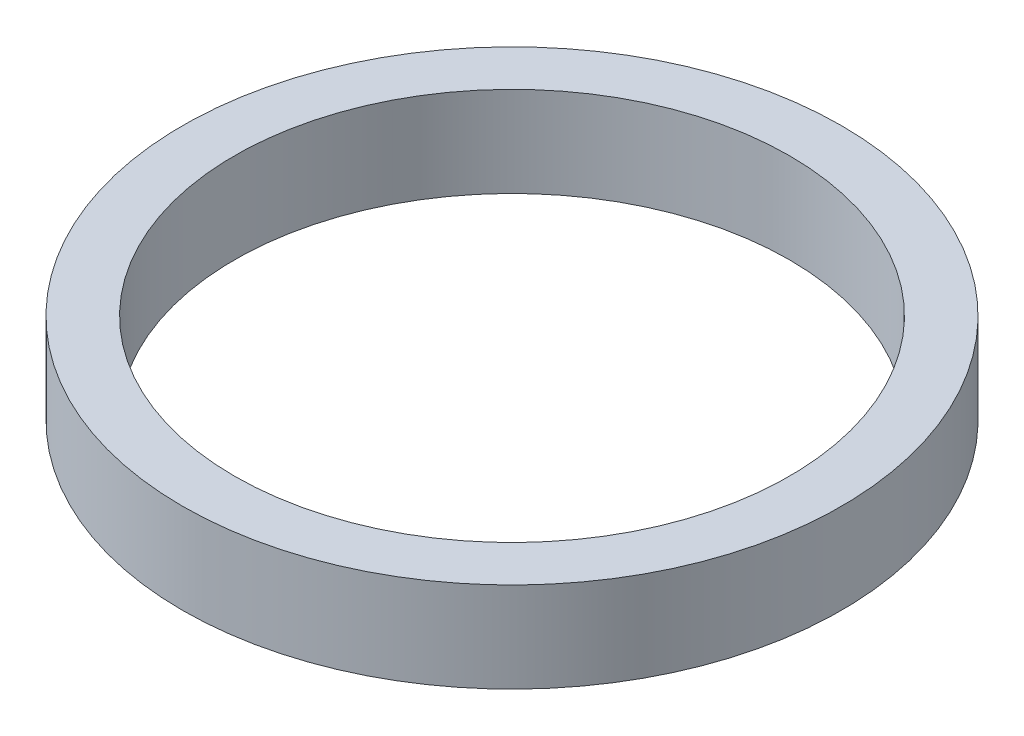
ISO-10303-21;
HEADER;
FILE_DESCRIPTION(('STEP AP214'),'2;1');
FILE_NAME('part.step','',(''),(''),'','','');
FILE_SCHEMA(('AUTOMOTIVE_DESIGN { 1 0 10303 214 1 1 1 1 }'));
ENDSEC;
DATA;
#1=APPLICATION_CONTEXT('core data for automotive mechanical design processes');
#2=APPLICATION_PROTOCOL_DEFINITION('international standard','automotive_design',2000,#1);
#3=PRODUCT_CONTEXT('',#1,'mechanical');
#4=PRODUCT('Part','Part','',(#3));
#5=PRODUCT_RELATED_PRODUCT_CATEGORY('part','',(#4));
#6=PRODUCT_DEFINITION_FORMATION('','',#4);
#7=PRODUCT_DEFINITION_CONTEXT('part definition',#1,'design');
#8=PRODUCT_DEFINITION('design','',#6,#7);
#9=PRODUCT_DEFINITION_SHAPE('','',#8);
#10=(LENGTH_UNIT() NAMED_UNIT(*) SI_UNIT(.MILLI.,.METRE.));
#11=(NAMED_UNIT(*) PLANE_ANGLE_UNIT() SI_UNIT($,.RADIAN.));
#12=(NAMED_UNIT(*) SI_UNIT($,.STERADIAN.) SOLID_ANGLE_UNIT());
#13=UNCERTAINTY_MEASURE_WITH_UNIT(LENGTH_MEASURE(1.E-05),#10,'distance_accuracy_value','');
#14=(GEOMETRIC_REPRESENTATION_CONTEXT(3) GLOBAL_UNCERTAINTY_ASSIGNED_CONTEXT((#13)) GLOBAL_UNIT_ASSIGNED_CONTEXT((#10,
#11,#12)) REPRESENTATION_CONTEXT('',''));
#15=CARTESIAN_POINT('',(0.,0.,0.));
#16=DIRECTION('',(0.,0.,1.));
#17=DIRECTION('',(1.,0.,0.));
#18=AXIS2_PLACEMENT_3D('',#15,#16,#17);
#19=CARTESIAN_POINT('',(0.,13.,0.));
#20=DIRECTION('',(0.,-1.,0.));
#21=DIRECTION('',(0.,0.,-1.));
#22=AXIS2_PLACEMENT_3D('',#19,#20,#21);
#23=CYLINDRICAL_SURFACE('',#22,47.5);
#24=CARTESIAN_POINT('',(0.,13.,0.));
#25=DIRECTION('',(0.,1.,0.));
#26=DIRECTION('',(0.,0.,1.));
#27=AXIS2_PLACEMENT_3D('',#24,#25,#26);
#28=CIRCLE('',#27,47.5);
#29=CARTESIAN_POINT('',(0.,13.,-47.5));
#30=VERTEX_POINT('',#29);
#31=EDGE_CURVE('E10',#30,#30,#28,.T.);
#32=CARTESIAN_POINT('',(0.,0.,0.));
#33=DIRECTION('',(0.,1.,0.));
#34=DIRECTION('',(0.,0.,1.));
#35=AXIS2_PLACEMENT_3D('',#32,#33,#34);
#36=CIRCLE('',#35,47.5);
#37=CARTESIAN_POINT('',(0.,0.,-47.5));
#38=VERTEX_POINT('',#37);
#39=EDGE_CURVE('E37',#38,#38,#36,.T.);
#40=CARTESIAN_POINT('',(0.,13.,-47.5));
#41=CARTESIAN_POINT('',(0.,12.8645833333333,-47.5));
#42=CARTESIAN_POINT('',(0.,12.7291666666667,-47.5));
#43=CARTESIAN_POINT('',(0.,12.4583333333333,-47.5));
#44=CARTESIAN_POINT('',(0.,12.3229166666667,-47.5));
#45=CARTESIAN_POINT('',(0.,12.0520833333333,-47.5));
#46=CARTESIAN_POINT('',(0.,11.9166666666667,-47.5));
#47=CARTESIAN_POINT('',(0.,11.6458333333333,-47.5));
#48=CARTESIAN_POINT('',(0.,11.5104166666667,-47.5));
#49=CARTESIAN_POINT('',(0.,11.2395833333333,-47.5));
#50=CARTESIAN_POINT('',(0.,11.1041666666667,-47.5));
#51=CARTESIAN_POINT('',(0.,10.8333333333333,-47.5));
#52=CARTESIAN_POINT('',(0.,10.6979166666667,-47.5));
#53=CARTESIAN_POINT('',(0.,10.4270833333333,-47.5));
#54=CARTESIAN_POINT('',(0.,10.2916666666667,-47.5));
#55=CARTESIAN_POINT('',(0.,10.0208333333333,-47.5));
#56=CARTESIAN_POINT('',(0.,9.88541666666667,-47.5));
#57=CARTESIAN_POINT('',(0.,9.61458333333333,-47.5));
#58=CARTESIAN_POINT('',(0.,9.47916666666667,-47.5));
#59=CARTESIAN_POINT('',(0.,9.20833333333333,-47.5));
#60=CARTESIAN_POINT('',(0.,9.07291666666666,-47.5));
#61=CARTESIAN_POINT('',(0.,8.80208333333333,-47.5));
#62=CARTESIAN_POINT('',(0.,8.66666666666667,-47.5));
#63=CARTESIAN_POINT('',(0.,8.39583333333333,-47.5));
#64=CARTESIAN_POINT('',(0.,8.26041666666667,-47.5));
#65=CARTESIAN_POINT('',(0.,7.98958333333333,-47.5));
#66=CARTESIAN_POINT('',(0.,7.85416666666667,-47.5));
#67=CARTESIAN_POINT('',(0.,7.58333333333333,-47.5));
#68=CARTESIAN_POINT('',(0.,7.44791666666667,-47.5));
#69=CARTESIAN_POINT('',(0.,7.17708333333333,-47.5));
#70=CARTESIAN_POINT('',(0.,7.04166666666667,-47.5));
#71=CARTESIAN_POINT('',(0.,6.77083333333333,-47.5));
#72=CARTESIAN_POINT('',(0.,6.63541666666667,-47.5));
#73=CARTESIAN_POINT('',(0.,6.36458333333333,-47.5));
#74=CARTESIAN_POINT('',(0.,6.22916666666667,-47.5));
#75=CARTESIAN_POINT('',(0.,5.95833333333333,-47.5));
#76=CARTESIAN_POINT('',(0.,5.82291666666667,-47.5));
#77=CARTESIAN_POINT('',(0.,5.55208333333333,-47.5));
#78=CARTESIAN_POINT('',(0.,5.41666666666667,-47.5));
#79=CARTESIAN_POINT('',(0.,5.14583333333333,-47.5));
#80=CARTESIAN_POINT('',(0.,5.01041666666667,-47.5));
#81=CARTESIAN_POINT('',(0.,4.73958333333333,-47.5));
#82=CARTESIAN_POINT('',(0.,4.60416666666667,-47.5));
#83=CARTESIAN_POINT('',(0.,4.33333333333333,-47.5));
#84=CARTESIAN_POINT('',(0.,4.19791666666667,-47.5));
#85=CARTESIAN_POINT('',(0.,3.92708333333333,-47.5));
#86=CARTESIAN_POINT('',(0.,3.79166666666667,-47.5));
#87=CARTESIAN_POINT('',(0.,3.52083333333333,-47.5));
#88=CARTESIAN_POINT('',(0.,3.38541666666667,-47.5));
#89=CARTESIAN_POINT('',(0.,3.11458333333333,-47.5));
#90=CARTESIAN_POINT('',(0.,2.97916666666667,-47.5));
#91=CARTESIAN_POINT('',(0.,2.70833333333333,-47.5));
#92=CARTESIAN_POINT('',(0.,2.57291666666667,-47.5));
#93=CARTESIAN_POINT('',(0.,2.30208333333333,-47.5));
#94=CARTESIAN_POINT('',(0.,2.16666666666667,-47.5));
#95=CARTESIAN_POINT('',(0.,1.89583333333333,-47.5));
#96=CARTESIAN_POINT('',(0.,1.76041666666667,-47.5));
#97=CARTESIAN_POINT('',(0.,1.48958333333333,-47.5));
#98=CARTESIAN_POINT('',(0.,1.35416666666667,-47.5));
#99=CARTESIAN_POINT('',(0.,1.08333333333333,-47.5));
#100=CARTESIAN_POINT('',(0.,0.947916666666667,-47.5));
#101=CARTESIAN_POINT('',(0.,0.677083333333334,-47.5));
#102=CARTESIAN_POINT('',(0.,0.541666666666667,-47.5));
#103=CARTESIAN_POINT('',(0.,0.270833333333334,-47.5));
#104=CARTESIAN_POINT('',(0.,0.135416666666667,-47.5));
#105=CARTESIAN_POINT('',(0.,0.,-47.5));
#106=B_SPLINE_CURVE_WITH_KNOTS('',3,(#40,#41,#42,#43,#44,#45,#46,#47,#48,#49,#50,#51,#52,#53,
#54,#55,#56,#57,#58,#59,#60,#61,#62,#63,#64,#65,#66,#67,#68,#69,#70,#71,#72,#73,#74,#75,#76,#77,
#78,#79,#80,#81,#82,#83,#84,#85,#86,#87,#88,#89,#90,#91,#92,#93,#94,#95,#96,#97,#98,#99,#100,
#101,#102,#103,#104,#105),.UNSPECIFIED.,.F.,.F.,(4,2,2,2,2,2,2,2,2,2,2,2,2,2,2,2,2,2,2,2,2,2,2,
2,2,2,2,2,2,2,2,2,4),(0.,0.40625,0.812500000000001,1.21875,1.625,2.03125,2.4375,2.84375,3.25,
3.65625,4.0625,4.46875,4.875,5.28125,5.6875,6.09375,6.5,6.90625,7.3125,7.71875,8.125,8.53125,
8.9375,9.34375,9.75,10.15625,10.5625,10.96875,11.375,11.78125,12.1875,12.59375,13.),.UNSPECIFIED.);
#107=EDGE_CURVE('BSEAM40',#30,#38,#106,.T.);
#108=ORIENTED_EDGE('',*,*,#31,.F.);
#109=ORIENTED_EDGE('',*,*,#39,.T.);
#110=ORIENTED_EDGE('',*,*,#107,.T.);
#111=ORIENTED_EDGE('',*,*,#107,.F.);
#112=EDGE_LOOP('',(#108,#110,#109,#111));
#113=FACE_BOUND('',#112,.T.);
#114=ADVANCED_FACE('F40',(#113),#23,.T.);
#115=CARTESIAN_POINT('',(0.,13.,0.));
#116=DIRECTION('',(0.,1.,0.));
#117=DIRECTION('',(0.,0.,1.));
#118=AXIS2_PLACEMENT_3D('',#115,#116,#117);
#119=PLANE('',#118);
#120=CARTESIAN_POINT('',(0.,13.,0.));
#121=DIRECTION('',(0.,1.,0.));
#122=DIRECTION('',(0.,0.,1.));
#123=AXIS2_PLACEMENT_3D('',#120,#121,#122);
#124=CIRCLE('',#123,40.);
#125=CARTESIAN_POINT('',(0.,13.,-40.));
#126=VERTEX_POINT('',#125);
#127=EDGE_CURVE('E50',#126,#126,#124,.T.);
#128=ORIENTED_EDGE('',*,*,#127,.F.);
#129=EDGE_LOOP('',(#128));
#130=FACE_BOUND('',#129,.T.);
#131=ORIENTED_EDGE('',*,*,#31,.T.);
#132=EDGE_LOOP('',(#131));
#133=FACE_BOUND('',#132,.T.);
#134=ADVANCED_FACE('F59',(#130,#133),#119,.T.);
#135=CARTESIAN_POINT('',(0.,0.,0.));
#136=DIRECTION('',(0.,1.,0.));
#137=DIRECTION('',(0.,0.,1.));
#138=AXIS2_PLACEMENT_3D('',#135,#136,#137);
#139=PLANE('',#138);
#140=CARTESIAN_POINT('',(0.,0.,0.));
#141=DIRECTION('',(0.,1.,0.));
#142=DIRECTION('',(0.,0.,1.));
#143=AXIS2_PLACEMENT_3D('',#140,#141,#142);
#144=CIRCLE('',#143,40.);
#145=CARTESIAN_POINT('',(0.,0.,-40.));
#146=VERTEX_POINT('',#145);
#147=EDGE_CURVE('E47',#146,#146,#144,.T.);
#148=ORIENTED_EDGE('',*,*,#147,.T.);
#149=EDGE_LOOP('',(#148));
#150=FACE_BOUND('',#149,.T.);
#151=ORIENTED_EDGE('',*,*,#39,.F.);
#152=EDGE_LOOP('',(#151));
#153=FACE_BOUND('',#152,.T.);
#154=ADVANCED_FACE('F58',(#150,#153),#139,.F.);
#155=CARTESIAN_POINT('',(0.,13.,0.));
#156=DIRECTION('',(0.,-1.,0.));
#157=DIRECTION('',(0.,0.,-1.));
#158=AXIS2_PLACEMENT_3D('',#155,#156,#157);
#159=CYLINDRICAL_SURFACE('',#158,40.);
#160=CARTESIAN_POINT('',(0.,13.,-40.));
#161=CARTESIAN_POINT('',(0.,12.8645833333333,-40.));
#162=CARTESIAN_POINT('',(0.,12.7291666666667,-40.));
#163=CARTESIAN_POINT('',(0.,12.4583333333333,-40.));
#164=CARTESIAN_POINT('',(0.,12.3229166666667,-40.));
#165=CARTESIAN_POINT('',(0.,12.0520833333333,-40.));
#166=CARTESIAN_POINT('',(0.,11.9166666666667,-40.));
#167=CARTESIAN_POINT('',(0.,11.6458333333333,-40.));
#168=CARTESIAN_POINT('',(0.,11.5104166666667,-40.));
#169=CARTESIAN_POINT('',(0.,11.2395833333333,-40.));
#170=CARTESIAN_POINT('',(0.,11.1041666666667,-40.));
#171=CARTESIAN_POINT('',(0.,10.8333333333333,-40.));
#172=CARTESIAN_POINT('',(0.,10.6979166666667,-40.));
#173=CARTESIAN_POINT('',(0.,10.4270833333333,-40.));
#174=CARTESIAN_POINT('',(0.,10.2916666666667,-40.));
#175=CARTESIAN_POINT('',(0.,10.0208333333333,-40.));
#176=CARTESIAN_POINT('',(0.,9.88541666666667,-40.));
#177=CARTESIAN_POINT('',(0.,9.61458333333333,-40.));
#178=CARTESIAN_POINT('',(0.,9.47916666666667,-40.));
#179=CARTESIAN_POINT('',(0.,9.20833333333333,-40.));
#180=CARTESIAN_POINT('',(0.,9.07291666666667,-40.));
#181=CARTESIAN_POINT('',(0.,8.80208333333333,-40.));
#182=CARTESIAN_POINT('',(0.,8.66666666666667,-40.));
#183=CARTESIAN_POINT('',(0.,8.39583333333333,-40.));
#184=CARTESIAN_POINT('',(0.,8.26041666666667,-40.));
#185=CARTESIAN_POINT('',(0.,7.98958333333333,-40.));
#186=CARTESIAN_POINT('',(0.,7.85416666666667,-40.));
#187=CARTESIAN_POINT('',(0.,7.58333333333333,-40.));
#188=CARTESIAN_POINT('',(0.,7.44791666666667,-40.));
#189=CARTESIAN_POINT('',(0.,7.17708333333333,-40.));
#190=CARTESIAN_POINT('',(0.,7.04166666666667,-40.));
#191=CARTESIAN_POINT('',(0.,6.77083333333333,-40.));
#192=CARTESIAN_POINT('',(0.,6.63541666666667,-40.));
#193=CARTESIAN_POINT('',(0.,6.36458333333333,-40.));
#194=CARTESIAN_POINT('',(0.,6.22916666666667,-40.));
#195=CARTESIAN_POINT('',(0.,5.95833333333333,-40.));
#196=CARTESIAN_POINT('',(0.,5.82291666666667,-40.));
#197=CARTESIAN_POINT('',(0.,5.55208333333333,-40.));
#198=CARTESIAN_POINT('',(0.,5.41666666666667,-40.));
#199=CARTESIAN_POINT('',(0.,5.14583333333333,-40.));
#200=CARTESIAN_POINT('',(0.,5.01041666666667,-40.));
#201=CARTESIAN_POINT('',(0.,4.73958333333333,-40.));
#202=CARTESIAN_POINT('',(0.,4.60416666666667,-40.));
#203=CARTESIAN_POINT('',(0.,4.33333333333333,-40.));
#204=CARTESIAN_POINT('',(0.,4.19791666666667,-40.));
#205=CARTESIAN_POINT('',(0.,3.92708333333333,-40.));
#206=CARTESIAN_POINT('',(0.,3.79166666666667,-40.));
#207=CARTESIAN_POINT('',(0.,3.52083333333333,-40.));
#208=CARTESIAN_POINT('',(0.,3.38541666666667,-40.));
#209=CARTESIAN_POINT('',(0.,3.11458333333333,-40.));
#210=CARTESIAN_POINT('',(0.,2.97916666666667,-40.));
#211=CARTESIAN_POINT('',(0.,2.70833333333333,-40.));
#212=CARTESIAN_POINT('',(0.,2.57291666666667,-40.));
#213=CARTESIAN_POINT('',(0.,2.30208333333333,-40.));
#214=CARTESIAN_POINT('',(0.,2.16666666666667,-40.));
#215=CARTESIAN_POINT('',(0.,1.89583333333333,-40.));
#216=CARTESIAN_POINT('',(0.,1.76041666666667,-40.));
#217=CARTESIAN_POINT('',(0.,1.48958333333333,-40.));
#218=CARTESIAN_POINT('',(0.,1.35416666666667,-40.));
#219=CARTESIAN_POINT('',(0.,1.08333333333333,-40.));
#220=CARTESIAN_POINT('',(0.,0.947916666666667,-40.));
#221=CARTESIAN_POINT('',(0.,0.677083333333334,-40.));
#222=CARTESIAN_POINT('',(0.,0.541666666666667,-40.));
#223=CARTESIAN_POINT('',(0.,0.270833333333334,-40.));
#224=CARTESIAN_POINT('',(0.,0.135416666666667,-40.));
#225=CARTESIAN_POINT('',(0.,0.,-40.));
#226=B_SPLINE_CURVE_WITH_KNOTS('',3,(#160,#161,#162,#163,#164,#165,#166,#167,#168,#169,#170,
#171,#172,#173,#174,#175,#176,#177,#178,#179,#180,#181,#182,#183,#184,#185,#186,#187,#188,#189,
#190,#191,#192,#193,#194,#195,#196,#197,#198,#199,#200,#201,#202,#203,#204,#205,#206,#207,#208,
#209,#210,#211,#212,#213,#214,#215,#216,#217,#218,#219,#220,#221,#222,#223,#224,#225),
.UNSPECIFIED.,.F.,.F.,(4,2,2,2,2,2,2,2,2,2,2,2,2,2,2,2,2,2,2,2,2,2,2,2,2,2,2,2,2,2,2,2,4),(0.,
0.406249999999999,0.812499999999999,1.21875,1.625,2.03125,2.4375,2.84375,3.25,3.65625,4.0625,
4.46875,4.875,5.28125,5.6875,6.09375,6.5,6.90625,7.3125,7.71875,8.125,8.53125,8.9375,9.34375,
9.75,10.15625,10.5625,10.96875,11.375,11.78125,12.1875,12.59375,13.),.UNSPECIFIED.);
#227=EDGE_CURVE('BSEAM54',#126,#146,#226,.T.);
#228=ORIENTED_EDGE('',*,*,#127,.T.);
#229=ORIENTED_EDGE('',*,*,#147,.F.);
#230=ORIENTED_EDGE('',*,*,#227,.T.);
#231=ORIENTED_EDGE('',*,*,#227,.F.);
#232=EDGE_LOOP('',(#228,#230,#229,#231));
#233=FACE_BOUND('',#232,.T.);
#234=ADVANCED_FACE('F54',(#233),#159,.F.);
#235=CLOSED_SHELL('',(#114,#134,#154,#234));
#236=MANIFOLD_SOLID_BREP('B2',#235);
#237=ADVANCED_BREP_SHAPE_REPRESENTATION('',(#18,#236),#14);
#238=SHAPE_DEFINITION_REPRESENTATION(#9,#237);
ENDSEC;
END-ISO-10303-21;
